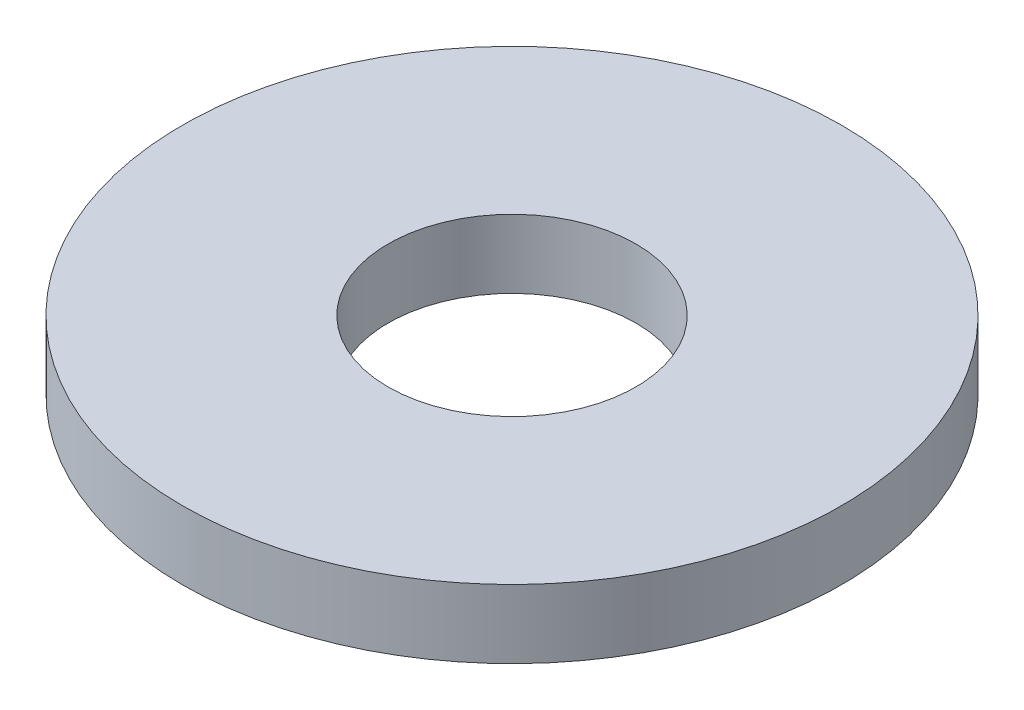
ISO-10303-21;
HEADER;
FILE_DESCRIPTION(('STEP AP214'),'2;1');
FILE_NAME('part.step','',(''),(''),'','','');
FILE_SCHEMA(('AUTOMOTIVE_DESIGN { 1 0 10303 214 1 1 1 1 }'));
ENDSEC;
DATA;
#1=APPLICATION_CONTEXT('core data for automotive mechanical design processes');
#2=APPLICATION_PROTOCOL_DEFINITION('international standard','automotive_design',2000,#1);
#3=PRODUCT_CONTEXT('',#1,'mechanical');
#4=PRODUCT('Part','Part','',(#3));
#5=PRODUCT_RELATED_PRODUCT_CATEGORY('part','',(#4));
#6=PRODUCT_DEFINITION_FORMATION('','',#4);
#7=PRODUCT_DEFINITION_CONTEXT('part definition',#1,'design');
#8=PRODUCT_DEFINITION('design','',#6,#7);
#9=PRODUCT_DEFINITION_SHAPE('','',#8);
#10=(LENGTH_UNIT() NAMED_UNIT(*) SI_UNIT(.MILLI.,.METRE.));
#11=(NAMED_UNIT(*) PLANE_ANGLE_UNIT() SI_UNIT($,.RADIAN.));
#12=(NAMED_UNIT(*) SI_UNIT($,.STERADIAN.) SOLID_ANGLE_UNIT());
#13=UNCERTAINTY_MEASURE_WITH_UNIT(LENGTH_MEASURE(1.E-05),#10,'distance_accuracy_value','');
#14=(GEOMETRIC_REPRESENTATION_CONTEXT(3) GLOBAL_UNCERTAINTY_ASSIGNED_CONTEXT((#13)) GLOBAL_UNIT_ASSIGNED_CONTEXT((#10,
#11,#12)) REPRESENTATION_CONTEXT('',''));
#15=CARTESIAN_POINT('',(0.,0.,0.));
#16=DIRECTION('',(0.,0.,1.));
#17=DIRECTION('',(1.,0.,0.));
#18=AXIS2_PLACEMENT_3D('',#15,#16,#17);
#19=CARTESIAN_POINT('',(-1.38777878078145E-13,0.990600000000008,-1.45716771982052E-13));
#20=DIRECTION('',(0.,-1.,0.));
#21=DIRECTION('',(0.,0.,-0.999999999999988));
#22=AXIS2_PLACEMENT_3D('',#19,#20,#21);
#23=CYLINDRICAL_SURFACE('',#22,4.7625);
#24=CARTESIAN_POINT('',(-1.38777878078145E-13,0.990600000000008,-1.45716771982052E-13));
#25=DIRECTION('',(0.,1.,0.));
#26=DIRECTION('',(0.,0.,0.999999999999988));
#27=AXIS2_PLACEMENT_3D('',#24,#25,#26);
#28=CIRCLE('',#27,4.7625);
#29=CARTESIAN_POINT('',(-1.51021599739676E-13,0.990599999999939,4.7624999999998));
#30=VERTEX_POINT('',#29);
#31=EDGE_CURVE('E12',#30,#30,#28,.T.);
#32=ORIENTED_EDGE('',*,*,#31,.F.);
#33=EDGE_LOOP('',(#32));
#34=FACE_BOUND('',#33,.T.);
#35=CARTESIAN_POINT('',(0.,0.,0.));
#36=DIRECTION('',(0.,1.,0.));
#37=DIRECTION('',(0.,0.,0.999999999999988));
#38=AXIS2_PLACEMENT_3D('',#35,#36,#37);
#39=CIRCLE('',#38,4.7625);
#40=CARTESIAN_POINT('',(0.,0.,4.76249999999994));
#41=VERTEX_POINT('',#40);
#42=EDGE_CURVE('E53',#41,#41,#39,.T.);
#43=ORIENTED_EDGE('',*,*,#42,.T.);
#44=EDGE_LOOP('',(#43));
#45=FACE_BOUND('',#44,.T.);
#46=ADVANCED_FACE('F50',(#34,#45),#23,.T.);
#47=CARTESIAN_POINT('',(-1.38777878078145E-13,0.990600000000008,-1.45716771982052E-13));
#48=DIRECTION('',(0.,1.,0.));
#49=DIRECTION('',(0.,0.,0.999999999999988));
#50=AXIS2_PLACEMENT_3D('',#47,#48,#49);
#51=PLANE('',#50);
#52=CARTESIAN_POINT('',(-1.38777878078145E-13,0.990600000000008,-1.45716771982052E-13));
#53=DIRECTION('',(0.,1.,0.));
#54=DIRECTION('',(0.,0.,0.999999999999988));
#55=AXIS2_PLACEMENT_3D('',#52,#53,#54);
#56=CIRCLE('',#55,1.7907);
#57=CARTESIAN_POINT('',(-1.4338151742288E-13,0.990599999999982,1.79069999999983));
#58=VERTEX_POINT('',#57);
#59=EDGE_CURVE('E65',#58,#58,#56,.T.);
#60=ORIENTED_EDGE('',*,*,#59,.F.);
#61=EDGE_LOOP('',(#60));
#62=FACE_BOUND('',#61,.T.);
#63=ORIENTED_EDGE('',*,*,#31,.T.);
#64=EDGE_LOOP('',(#63));
#65=FACE_BOUND('',#64,.T.);
#66=ADVANCED_FACE('F81',(#62,#65),#51,.T.);
#67=CARTESIAN_POINT('',(0.,0.,0.));
#68=DIRECTION('',(0.,1.,0.));
#69=DIRECTION('',(0.,0.,0.999999999999988));
#70=AXIS2_PLACEMENT_3D('',#67,#68,#69);
#71=PLANE('',#70);
#72=CARTESIAN_POINT('',(0.,0.,0.));
#73=DIRECTION('',(0.,1.,0.));
#74=DIRECTION('',(0.,0.,0.999999999999988));
#75=AXIS2_PLACEMENT_3D('',#72,#73,#74);
#76=CIRCLE('',#75,1.7907);
#77=CARTESIAN_POINT('',(0.,0.,1.79069999999998));
#78=VERTEX_POINT('',#77);
#79=EDGE_CURVE('E63',#78,#78,#76,.T.);
#80=ORIENTED_EDGE('',*,*,#79,.T.);
#81=EDGE_LOOP('',(#80));
#82=FACE_BOUND('',#81,.T.);
#83=ORIENTED_EDGE('',*,*,#42,.F.);
#84=EDGE_LOOP('',(#83));
#85=FACE_BOUND('',#84,.T.);
#86=ADVANCED_FACE('F72',(#82,#85),#71,.F.);
#87=CARTESIAN_POINT('',(0.,0.,0.));
#88=DIRECTION('',(0.,1.,0.));
#89=DIRECTION('',(0.,0.,0.999999999999988));
#90=AXIS2_PLACEMENT_3D('',#87,#88,#89);
#91=CYLINDRICAL_SURFACE('',#90,1.7907);
#92=ORIENTED_EDGE('',*,*,#79,.F.);
#93=EDGE_LOOP('',(#92));
#94=FACE_BOUND('',#93,.T.);
#95=ORIENTED_EDGE('',*,*,#59,.T.);
#96=EDGE_LOOP('',(#95));
#97=FACE_BOUND('',#96,.T.);
#98=ADVANCED_FACE('F75',(#94,#97),#91,.F.);
#99=CLOSED_SHELL('',(#46,#66,#86,#98));
#100=MANIFOLD_SOLID_BREP('B2',#99);
#101=ADVANCED_BREP_SHAPE_REPRESENTATION('',(#18,#100),#14);
#102=SHAPE_DEFINITION_REPRESENTATION(#9,#101);
ENDSEC;
END-ISO-10303-21;
